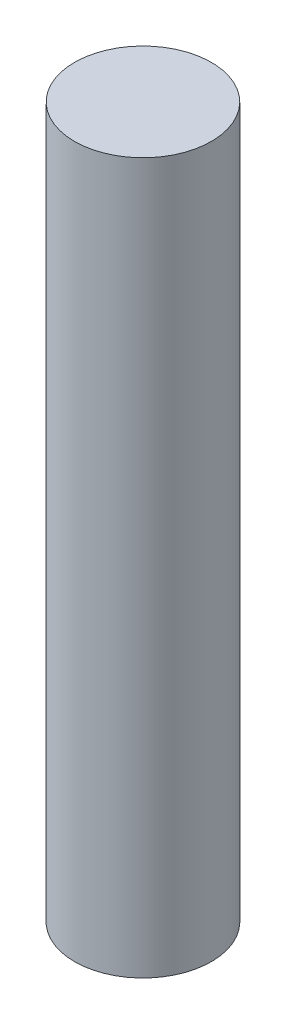
ISO-10303-21;
HEADER;
FILE_DESCRIPTION(('STEP AP214'),'2;1');
FILE_NAME('part.step','',(''),(''),'','','');
FILE_SCHEMA(('AUTOMOTIVE_DESIGN { 1 0 10303 214 1 1 1 1 }'));
ENDSEC;
DATA;
#1=APPLICATION_CONTEXT('core data for automotive mechanical design processes');
#2=APPLICATION_PROTOCOL_DEFINITION('international standard','automotive_design',2000,#1);
#3=PRODUCT_CONTEXT('',#1,'mechanical');
#4=PRODUCT('Part','Part','',(#3));
#5=PRODUCT_RELATED_PRODUCT_CATEGORY('part','',(#4));
#6=PRODUCT_DEFINITION_FORMATION('','',#4);
#7=PRODUCT_DEFINITION_CONTEXT('part definition',#1,'design');
#8=PRODUCT_DEFINITION('design','',#6,#7);
#9=PRODUCT_DEFINITION_SHAPE('','',#8);
#10=(LENGTH_UNIT() NAMED_UNIT(*) SI_UNIT(.MILLI.,.METRE.));
#11=(NAMED_UNIT(*) PLANE_ANGLE_UNIT() SI_UNIT($,.RADIAN.));
#12=(NAMED_UNIT(*) SI_UNIT($,.STERADIAN.) SOLID_ANGLE_UNIT());
#13=UNCERTAINTY_MEASURE_WITH_UNIT(LENGTH_MEASURE(1.E-05),#10,'distance_accuracy_value','');
#14=(GEOMETRIC_REPRESENTATION_CONTEXT(3) GLOBAL_UNCERTAINTY_ASSIGNED_CONTEXT((#13)) GLOBAL_UNIT_ASSIGNED_CONTEXT((#10,
#11,#12)) REPRESENTATION_CONTEXT('',''));
#15=CARTESIAN_POINT('',(0.,0.,0.));
#16=DIRECTION('',(0.,0.,1.));
#17=DIRECTION('',(1.,0.,0.));
#18=AXIS2_PLACEMENT_3D('',#15,#16,#17);
#19=CARTESIAN_POINT('',(0.,45.466,0.));
#20=DIRECTION('',(0.,-1.,0.));
#21=DIRECTION('',(0.,0.,-1.));
#22=AXIS2_PLACEMENT_3D('',#19,#20,#21);
#23=CYLINDRICAL_SURFACE('',#22,4.3815);
#24=CARTESIAN_POINT('',(0.,45.466,0.));
#25=DIRECTION('',(0.,1.,0.));
#26=DIRECTION('',(0.,0.,1.));
#27=AXIS2_PLACEMENT_3D('',#24,#25,#26);
#28=CIRCLE('',#27,4.3815);
#29=CARTESIAN_POINT('',(0.,45.466,4.3815));
#30=VERTEX_POINT('',#29);
#31=EDGE_CURVE('E10',#30,#30,#28,.T.);
#32=ORIENTED_EDGE('',*,*,#31,.F.);
#33=EDGE_LOOP('',(#32));
#34=FACE_BOUND('',#33,.T.);
#35=CARTESIAN_POINT('',(0.,0.,0.));
#36=DIRECTION('',(0.,1.,0.));
#37=DIRECTION('',(0.,0.,1.));
#38=AXIS2_PLACEMENT_3D('',#35,#36,#37);
#39=CIRCLE('',#38,4.3815);
#40=CARTESIAN_POINT('',(0.,0.,4.3815));
#41=VERTEX_POINT('',#40);
#42=EDGE_CURVE('E36',#41,#41,#39,.T.);
#43=ORIENTED_EDGE('',*,*,#42,.T.);
#44=EDGE_LOOP('',(#43));
#45=FACE_BOUND('',#44,.T.);
#46=ADVANCED_FACE('F33',(#34,#45),#23,.T.);
#47=CARTESIAN_POINT('',(0.,45.466,0.));
#48=DIRECTION('',(0.,1.,0.));
#49=DIRECTION('',(0.,0.,1.));
#50=AXIS2_PLACEMENT_3D('',#47,#48,#49);
#51=PLANE('',#50);
#52=ORIENTED_EDGE('',*,*,#31,.T.);
#53=EDGE_LOOP('',(#52));
#54=FACE_BOUND('',#53,.T.);
#55=ADVANCED_FACE('F48',(#54),#51,.T.);
#56=CARTESIAN_POINT('',(0.,0.,0.));
#57=DIRECTION('',(0.,1.,0.));
#58=DIRECTION('',(0.,0.,1.));
#59=AXIS2_PLACEMENT_3D('',#56,#57,#58);
#60=PLANE('',#59);
#61=ORIENTED_EDGE('',*,*,#42,.F.);
#62=EDGE_LOOP('',(#61));
#63=FACE_BOUND('',#62,.T.);
#64=ADVANCED_FACE('F46',(#63),#60,.F.);
#65=CLOSED_SHELL('',(#46,#55,#64));
#66=MANIFOLD_SOLID_BREP('B2',#65);
#67=ADVANCED_BREP_SHAPE_REPRESENTATION('',(#18,#66),#14);
#68=SHAPE_DEFINITION_REPRESENTATION(#9,#67);
ENDSEC;
END-ISO-10303-21;
